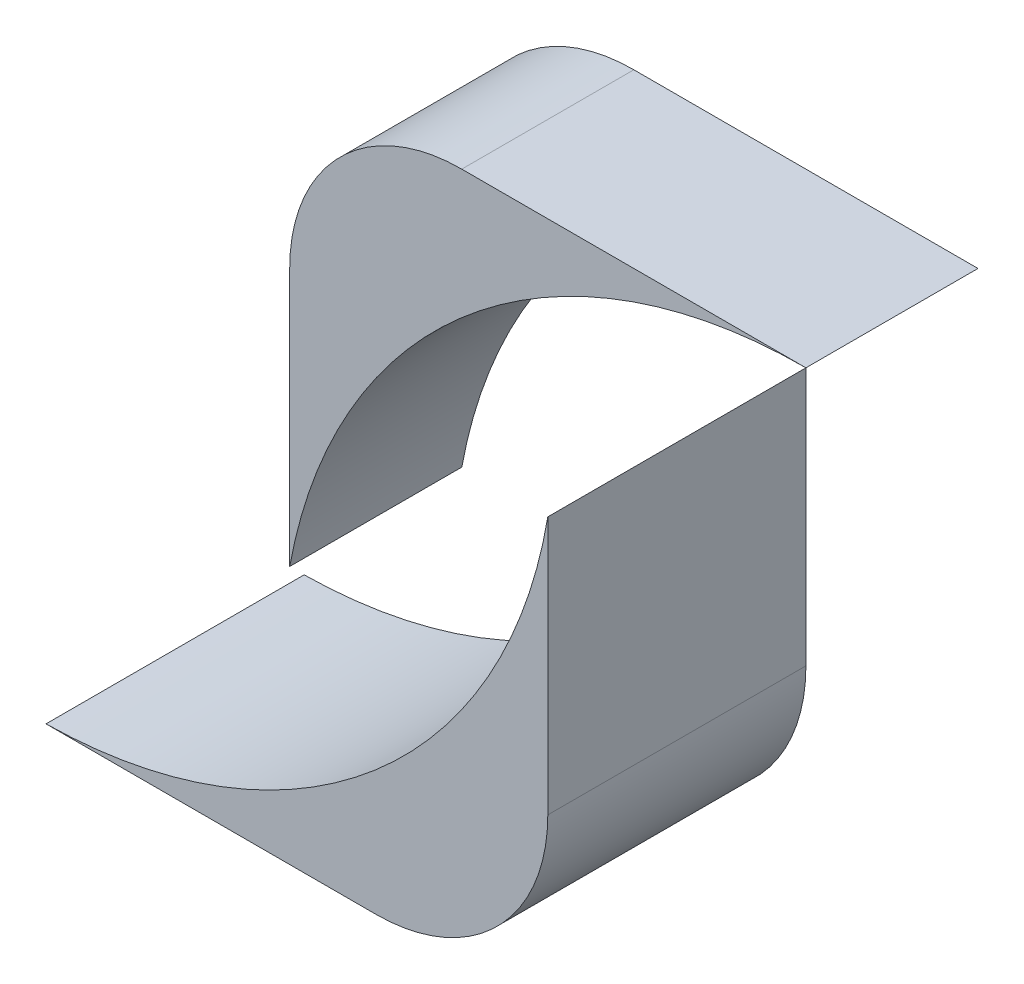
ISO-10303-21;
HEADER;
FILE_DESCRIPTION(('STEP AP214'),'2;1');
FILE_NAME('part.step','',(''),(''),'','','');
FILE_SCHEMA(('AUTOMOTIVE_DESIGN { 1 0 10303 214 1 1 1 1 }'));
ENDSEC;
DATA;
#1=APPLICATION_CONTEXT('core data for automotive mechanical design processes');
#2=APPLICATION_PROTOCOL_DEFINITION('international standard','automotive_design',2000,#1);
#3=PRODUCT_CONTEXT('',#1,'mechanical');
#4=PRODUCT('Part','Part','',(#3));
#5=PRODUCT_RELATED_PRODUCT_CATEGORY('part','',(#4));
#6=PRODUCT_DEFINITION_FORMATION('','',#4);
#7=PRODUCT_DEFINITION_CONTEXT('part definition',#1,'design');
#8=PRODUCT_DEFINITION('design','',#6,#7);
#9=PRODUCT_DEFINITION_SHAPE('','',#8);
#10=(LENGTH_UNIT() NAMED_UNIT(*) SI_UNIT(.MILLI.,.METRE.));
#11=(NAMED_UNIT(*) PLANE_ANGLE_UNIT() SI_UNIT($,.RADIAN.));
#12=(NAMED_UNIT(*) SI_UNIT($,.STERADIAN.) SOLID_ANGLE_UNIT());
#13=UNCERTAINTY_MEASURE_WITH_UNIT(LENGTH_MEASURE(1.E-05),#10,'distance_accuracy_value','');
#14=(GEOMETRIC_REPRESENTATION_CONTEXT(3) GLOBAL_UNCERTAINTY_ASSIGNED_CONTEXT((#13)) GLOBAL_UNIT_ASSIGNED_CONTEXT((#10,
#11,#12)) REPRESENTATION_CONTEXT('',''));
#15=CARTESIAN_POINT('',(0.,0.,0.));
#16=DIRECTION('',(0.,0.,1.));
#17=DIRECTION('',(1.,0.,0.));
#18=AXIS2_PLACEMENT_3D('',#15,#16,#17);
#19=CARTESIAN_POINT('',(0.419106371130974,29.9970723546428,25.));
#20=DIRECTION('',(0.,0.,-1.));
#21=DIRECTION('',(-1.,0.,0.));
#22=AXIS2_PLACEMENT_3D('',#19,#20,#21);
#23=CYLINDRICAL_SURFACE('',#22,30.);
#24=CARTESIAN_POINT('',(0.419106371130974,29.9970723546428,10.));
#25=DIRECTION('',(0.,0.,1.));
#26=DIRECTION('',(1.,0.,0.));
#27=AXIS2_PLACEMENT_3D('',#24,#25,#26);
#28=CIRCLE('',#27,30.);
#29=CARTESIAN_POINT('',(0.83821274226187,0.,10.));
#30=VERTEX_POINT('',#29);
#31=CARTESIAN_POINT('',(30.,25.,10.));
#32=VERTEX_POINT('',#31);
#33=EDGE_CURVE('E107',#30,#32,#28,.T.);
#34=ORIENTED_EDGE('',*,*,#33,.F.);
#35=DIRECTION('',(0.,0.,-1.));
#36=VECTOR('',#35,1.);
#37=CARTESIAN_POINT('',(0.83821274226187,0.,25.));
#38=LINE('',#37,#36);
#39=CARTESIAN_POINT('',(0.83821274226187,0.,25.));
#40=VERTEX_POINT('',#39);
#41=EDGE_CURVE('E12',#40,#30,#38,.T.);
#42=ORIENTED_EDGE('',*,*,#41,.F.);
#43=CARTESIAN_POINT('',(0.419106371130974,29.9970723546428,25.));
#44=DIRECTION('',(0.,0.,1.));
#45=DIRECTION('',(1.,0.,0.));
#46=AXIS2_PLACEMENT_3D('',#43,#44,#45);
#47=CIRCLE('',#46,30.);
#48=CARTESIAN_POINT('',(30.,25.,25.));
#49=VERTEX_POINT('',#48);
#50=EDGE_CURVE('E95',#40,#49,#47,.T.);
#51=ORIENTED_EDGE('',*,*,#50,.T.);
#52=DIRECTION('',(0.,0.,-1.));
#53=VECTOR('',#52,1.);
#54=CARTESIAN_POINT('',(30.,25.,25.));
#55=LINE('',#54,#53);
#56=EDGE_CURVE('E84',#49,#32,#55,.T.);
#57=ORIENTED_EDGE('',*,*,#56,.T.);
#58=EDGE_LOOP('',(#34,#42,#51,#57));
#59=FACE_BOUND('',#58,.T.);
#60=ADVANCED_FACE('F45',(#59),#23,.F.);
#61=CARTESIAN_POINT('',(0.,0.,25.));
#62=DIRECTION('',(0.,1.,0.));
#63=DIRECTION('',(-1.,0.,0.));
#64=AXIS2_PLACEMENT_3D('',#61,#62,#63);
#65=PLANE('',#64);
#66=DIRECTION('',(1.,0.,0.));
#67=VECTOR('',#66,1.);
#68=CARTESIAN_POINT('',(0.,0.,10.));
#69=LINE('',#68,#67);
#70=CARTESIAN_POINT('',(20.,0.,10.));
#71=VERTEX_POINT('',#70);
#72=EDGE_CURVE('E100',#30,#71,#69,.T.);
#73=ORIENTED_EDGE('',*,*,#72,.T.);
#74=DIRECTION('',(0.,0.,-1.));
#75=VECTOR('',#74,1.);
#76=CARTESIAN_POINT('',(20.,0.,25.));
#77=LINE('',#76,#75);
#78=CARTESIAN_POINT('',(20.,0.,25.));
#79=VERTEX_POINT('',#78);
#80=EDGE_CURVE('E53',#79,#71,#77,.T.);
#81=ORIENTED_EDGE('',*,*,#80,.F.);
#82=DIRECTION('',(1.,0.,0.));
#83=VECTOR('',#82,1.);
#84=CARTESIAN_POINT('',(0.,0.,25.));
#85=LINE('',#84,#83);
#86=EDGE_CURVE('E90',#40,#79,#85,.T.);
#87=ORIENTED_EDGE('',*,*,#86,.F.);
#88=ORIENTED_EDGE('',*,*,#41,.T.);
#89=EDGE_LOOP('',(#73,#81,#87,#88));
#90=FACE_BOUND('',#89,.T.);
#91=ADVANCED_FACE('F98',(#90),#65,.F.);
#92=CARTESIAN_POINT('',(20.,10.,25.));
#93=DIRECTION('',(0.,0.,-1.));
#94=DIRECTION('',(-1.,0.,0.));
#95=AXIS2_PLACEMENT_3D('',#92,#93,#94);
#96=CYLINDRICAL_SURFACE('',#95,10.);
#97=CARTESIAN_POINT('',(20.,10.,10.));
#98=DIRECTION('',(0.,0.,1.));
#99=DIRECTION('',(1.,0.,0.));
#100=AXIS2_PLACEMENT_3D('',#97,#98,#99);
#101=CIRCLE('',#100,10.);
#102=CARTESIAN_POINT('',(30.,10.,10.));
#103=VERTEX_POINT('',#102);
#104=EDGE_CURVE('E77',#71,#103,#101,.T.);
#105=ORIENTED_EDGE('',*,*,#104,.T.);
#106=DIRECTION('',(0.,0.,-1.));
#107=VECTOR('',#106,1.);
#108=CARTESIAN_POINT('',(30.,10.,25.));
#109=LINE('',#108,#107);
#110=CARTESIAN_POINT('',(30.,10.,25.));
#111=VERTEX_POINT('',#110);
#112=EDGE_CURVE('E101',#111,#103,#109,.T.);
#113=ORIENTED_EDGE('',*,*,#112,.F.);
#114=CARTESIAN_POINT('',(20.,10.,25.));
#115=DIRECTION('',(0.,0.,1.));
#116=DIRECTION('',(1.,0.,0.));
#117=AXIS2_PLACEMENT_3D('',#114,#115,#116);
#118=CIRCLE('',#117,10.);
#119=EDGE_CURVE('E94',#79,#111,#118,.T.);
#120=ORIENTED_EDGE('',*,*,#119,.F.);
#121=ORIENTED_EDGE('',*,*,#80,.T.);
#122=EDGE_LOOP('',(#105,#113,#120,#121));
#123=FACE_BOUND('',#122,.T.);
#124=ADVANCED_FACE('F102',(#123),#96,.T.);
#125=CARTESIAN_POINT('',(30.,0.,25.));
#126=DIRECTION('',(-1.,0.,0.));
#127=DIRECTION('',(0.,0.,1.));
#128=AXIS2_PLACEMENT_3D('',#125,#126,#127);
#129=PLANE('',#128);
#130=DIRECTION('',(0.,1.,0.));
#131=VECTOR('',#130,1.);
#132=CARTESIAN_POINT('',(30.,0.,10.));
#133=LINE('',#132,#131);
#134=EDGE_CURVE('E112',#103,#32,#133,.T.);
#135=ORIENTED_EDGE('',*,*,#134,.T.);
#136=ORIENTED_EDGE('',*,*,#56,.F.);
#137=DIRECTION('',(0.,1.,0.));
#138=VECTOR('',#137,1.);
#139=CARTESIAN_POINT('',(30.,0.,25.));
#140=LINE('',#139,#138);
#141=EDGE_CURVE('E61',#111,#49,#140,.T.);
#142=ORIENTED_EDGE('',*,*,#141,.F.);
#143=ORIENTED_EDGE('',*,*,#112,.T.);
#144=EDGE_LOOP('',(#135,#136,#142,#143));
#145=FACE_BOUND('',#144,.T.);
#146=ADVANCED_FACE('F117',(#145),#129,.F.);
#147=CARTESIAN_POINT('',(0.,0.,25.));
#148=DIRECTION('',(0.,0.,1.));
#149=DIRECTION('',(1.,0.,0.));
#150=AXIS2_PLACEMENT_3D('',#147,#148,#149);
#151=PLANE('',#150);
#152=ORIENTED_EDGE('',*,*,#50,.F.);
#153=ORIENTED_EDGE('',*,*,#86,.T.);
#154=ORIENTED_EDGE('',*,*,#119,.T.);
#155=ORIENTED_EDGE('',*,*,#141,.T.);
#156=EDGE_LOOP('',(#152,#153,#154,#155));
#157=FACE_BOUND('',#156,.T.);
#158=ADVANCED_FACE('F92',(#157),#151,.T.);
#159=CARTESIAN_POINT('',(0.,0.,10.));
#160=DIRECTION('',(0.,0.,1.));
#161=DIRECTION('',(1.,0.,0.));
#162=AXIS2_PLACEMENT_3D('',#159,#160,#161);
#163=PLANE('',#162);
#164=ORIENTED_EDGE('',*,*,#33,.T.);
#165=ORIENTED_EDGE('',*,*,#134,.F.);
#166=ORIENTED_EDGE('',*,*,#104,.F.);
#167=ORIENTED_EDGE('',*,*,#72,.F.);
#168=EDGE_LOOP('',(#164,#165,#166,#167));
#169=FACE_BOUND('',#168,.T.);
#170=ADVANCED_FACE('F119',(#169),#163,.F.);
#171=CLOSED_SHELL('',(#60,#91,#124,#146,#158,#170));
#172=MANIFOLD_SOLID_BREP('B2',#171);
#173=CARTESIAN_POINT('',(10.,15.,10.));
#174=DIRECTION('',(0.,0.,-1.));
#175=DIRECTION('',(-1.,0.,0.));
#176=AXIS2_PLACEMENT_3D('',#173,#174,#175);
#177=CYLINDRICAL_SURFACE('',#176,10.);
#178=CARTESIAN_POINT('',(10.,15.,0.));
#179=DIRECTION('',(0.,0.,1.));
#180=DIRECTION('',(-1.,0.,0.));
#181=AXIS2_PLACEMENT_3D('',#178,#179,#180);
#182=CIRCLE('',#181,10.);
#183=CARTESIAN_POINT('',(10.,25.,0.));
#184=VERTEX_POINT('',#183);
#185=CARTESIAN_POINT('',(0.,15.,0.));
#186=VERTEX_POINT('',#185);
#187=EDGE_CURVE('E232',#184,#186,#182,.T.);
#188=ORIENTED_EDGE('',*,*,#187,.T.);
#189=DIRECTION('',(0.,0.,-1.));
#190=VECTOR('',#189,1.);
#191=CARTESIAN_POINT('',(0.,15.,10.));
#192=LINE('',#191,#190);
#193=CARTESIAN_POINT('',(0.,15.,10.));
#194=VERTEX_POINT('',#193);
#195=EDGE_CURVE('E43',#194,#186,#192,.T.);
#196=ORIENTED_EDGE('',*,*,#195,.F.);
#197=CARTESIAN_POINT('',(10.,15.,10.));
#198=DIRECTION('',(0.,0.,1.));
#199=DIRECTION('',(-1.,0.,0.));
#200=AXIS2_PLACEMENT_3D('',#197,#198,#199);
#201=CIRCLE('',#200,10.);
#202=CARTESIAN_POINT('',(10.,25.,10.));
#203=VERTEX_POINT('',#202);
#204=EDGE_CURVE('E220',#203,#194,#201,.T.);
#205=ORIENTED_EDGE('',*,*,#204,.F.);
#206=DIRECTION('',(0.,0.,-1.));
#207=VECTOR('',#206,1.);
#208=CARTESIAN_POINT('',(10.,25.,10.));
#209=LINE('',#208,#207);
#210=EDGE_CURVE('E228',#203,#184,#209,.T.);
#211=ORIENTED_EDGE('',*,*,#210,.T.);
#212=EDGE_LOOP('',(#188,#196,#205,#211));
#213=FACE_BOUND('',#212,.T.);
#214=ADVANCED_FACE('F169',(#213),#177,.T.);
#215=CARTESIAN_POINT('',(0.,0.,10.));
#216=DIRECTION('',(1.,0.,0.));
#217=DIRECTION('',(0.,0.,-1.));
#218=AXIS2_PLACEMENT_3D('',#215,#216,#217);
#219=PLANE('',#218);
#220=DIRECTION('',(0.,-1.,0.));
#221=VECTOR('',#220,1.);
#222=CARTESIAN_POINT('',(0.,0.,0.));
#223=LINE('',#222,#221);
#224=CARTESIAN_POINT('',(0.,0.,0.));
#225=VERTEX_POINT('',#224);
#226=EDGE_CURVE('E224',#186,#225,#223,.T.);
#227=ORIENTED_EDGE('',*,*,#226,.T.);
#228=DIRECTION('',(0.,0.,-1.));
#229=VECTOR('',#228,1.);
#230=CARTESIAN_POINT('',(0.,0.,10.));
#231=LINE('',#230,#229);
#232=CARTESIAN_POINT('',(0.,0.,10.));
#233=VERTEX_POINT('',#232);
#234=EDGE_CURVE('E177',#233,#225,#231,.T.);
#235=ORIENTED_EDGE('',*,*,#234,.F.);
#236=DIRECTION('',(0.,-1.,0.));
#237=VECTOR('',#236,1.);
#238=CARTESIAN_POINT('',(0.,0.,10.));
#239=LINE('',#238,#237);
#240=EDGE_CURVE('E215',#194,#233,#239,.T.);
#241=ORIENTED_EDGE('',*,*,#240,.F.);
#242=ORIENTED_EDGE('',*,*,#195,.T.);
#243=EDGE_LOOP('',(#227,#235,#241,#242));
#244=FACE_BOUND('',#243,.T.);
#245=ADVANCED_FACE('F223',(#244),#219,.F.);
#246=CARTESIAN_POINT('',(30.,-5.50000000000002,10.));
#247=DIRECTION('',(0.,0.,-1.));
#248=DIRECTION('',(-1.,0.,0.));
#249=AXIS2_PLACEMENT_3D('',#246,#247,#248);
#250=CYLINDRICAL_SURFACE('',#249,30.5);
#251=CARTESIAN_POINT('',(30.,-5.50000000000002,0.));
#252=DIRECTION('',(0.,0.,-1.));
#253=DIRECTION('',(1.,0.,0.));
#254=AXIS2_PLACEMENT_3D('',#251,#252,#253);
#255=CIRCLE('',#254,30.5);
#256=CARTESIAN_POINT('',(30.,25.,0.));
#257=VERTEX_POINT('',#256);
#258=EDGE_CURVE('E202',#225,#257,#255,.T.);
#259=ORIENTED_EDGE('',*,*,#258,.T.);
#260=DIRECTION('',(0.,0.,-1.));
#261=VECTOR('',#260,1.);
#262=CARTESIAN_POINT('',(30.,25.,10.));
#263=LINE('',#262,#261);
#264=CARTESIAN_POINT('',(30.,25.,10.));
#265=VERTEX_POINT('',#264);
#266=EDGE_CURVE('E225',#265,#257,#263,.T.);
#267=ORIENTED_EDGE('',*,*,#266,.F.);
#268=CARTESIAN_POINT('',(30.,-5.50000000000002,10.));
#269=DIRECTION('',(0.,0.,-1.));
#270=DIRECTION('',(1.,0.,0.));
#271=AXIS2_PLACEMENT_3D('',#268,#269,#270);
#272=CIRCLE('',#271,30.5);
#273=EDGE_CURVE('E218',#233,#265,#272,.T.);
#274=ORIENTED_EDGE('',*,*,#273,.F.);
#275=ORIENTED_EDGE('',*,*,#234,.T.);
#276=EDGE_LOOP('',(#259,#267,#274,#275));
#277=FACE_BOUND('',#276,.T.);
#278=ADVANCED_FACE('F226',(#277),#250,.F.);
#279=CARTESIAN_POINT('',(10.,25.,10.));
#280=DIRECTION('',(0.,-1.,0.));
#281=DIRECTION('',(0.,0.,-1.));
#282=AXIS2_PLACEMENT_3D('',#279,#280,#281);
#283=PLANE('',#282);
#284=DIRECTION('',(-1.,0.,0.));
#285=VECTOR('',#284,1.);
#286=CARTESIAN_POINT('',(10.,25.,0.));
#287=LINE('',#286,#285);
#288=EDGE_CURVE('E208',#257,#184,#287,.T.);
#289=ORIENTED_EDGE('',*,*,#288,.T.);
#290=ORIENTED_EDGE('',*,*,#210,.F.);
#291=DIRECTION('',(-1.,0.,0.));
#292=VECTOR('',#291,1.);
#293=CARTESIAN_POINT('',(10.,25.,10.));
#294=LINE('',#293,#292);
#295=EDGE_CURVE('E185',#265,#203,#294,.T.);
#296=ORIENTED_EDGE('',*,*,#295,.F.);
#297=ORIENTED_EDGE('',*,*,#266,.T.);
#298=EDGE_LOOP('',(#289,#290,#296,#297));
#299=FACE_BOUND('',#298,.T.);
#300=ADVANCED_FACE('F239',(#299),#283,.F.);
#301=CARTESIAN_POINT('',(10.,15.,10.));
#302=DIRECTION('',(0.,0.,-1.));
#303=DIRECTION('',(-1.,0.,0.));
#304=AXIS2_PLACEMENT_3D('',#301,#302,#303);
#305=PLANE('',#304);
#306=ORIENTED_EDGE('',*,*,#204,.T.);
#307=ORIENTED_EDGE('',*,*,#240,.T.);
#308=ORIENTED_EDGE('',*,*,#273,.T.);
#309=ORIENTED_EDGE('',*,*,#295,.T.);
#310=EDGE_LOOP('',(#306,#307,#308,#309));
#311=FACE_BOUND('',#310,.T.);
#312=ADVANCED_FACE('F216',(#311),#305,.F.);
#313=CARTESIAN_POINT('',(10.,15.,0.));
#314=DIRECTION('',(0.,0.,-1.));
#315=DIRECTION('',(-1.,0.,0.));
#316=AXIS2_PLACEMENT_3D('',#313,#314,#315);
#317=PLANE('',#316);
#318=ORIENTED_EDGE('',*,*,#187,.F.);
#319=ORIENTED_EDGE('',*,*,#288,.F.);
#320=ORIENTED_EDGE('',*,*,#258,.F.);
#321=ORIENTED_EDGE('',*,*,#226,.F.);
#322=EDGE_LOOP('',(#318,#319,#320,#321));
#323=FACE_BOUND('',#322,.T.);
#324=ADVANCED_FACE('F242',(#323),#317,.T.);
#325=CLOSED_SHELL('',(#214,#245,#278,#300,#312,#324));
#326=MANIFOLD_SOLID_BREP('B6',#325);
#327=ADVANCED_BREP_SHAPE_REPRESENTATION('',(#18,#172,#326),#14);
#328=SHAPE_DEFINITION_REPRESENTATION(#9,#327);
ENDSEC;
END-ISO-10303-21;
